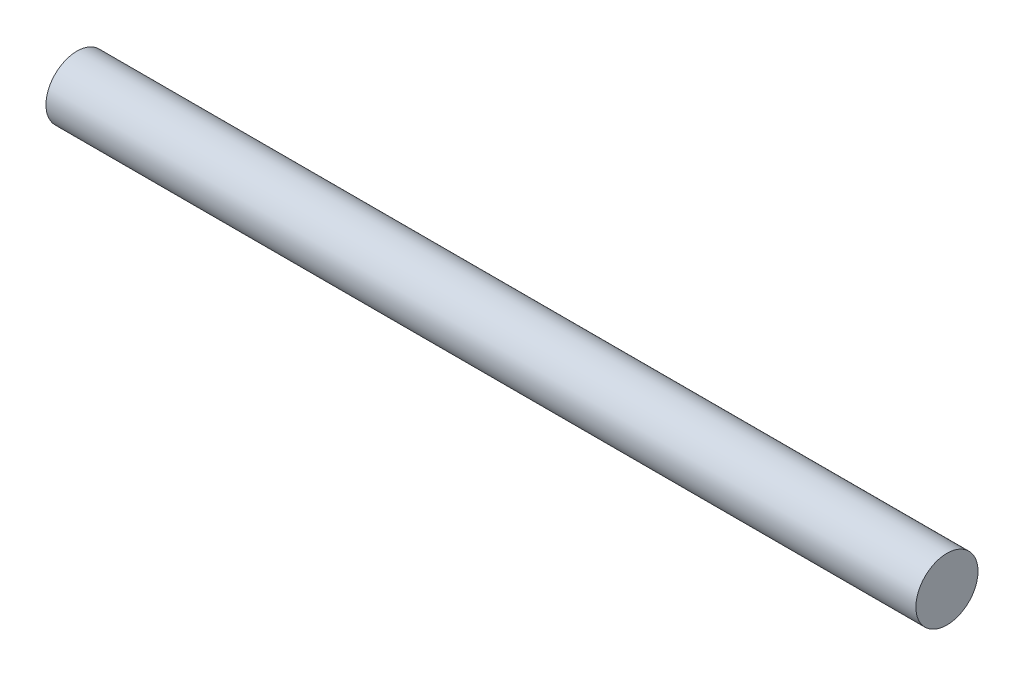
ISO-10303-21;
HEADER;
FILE_DESCRIPTION(('STEP AP214'),'2;1');
FILE_NAME('part.step','',(''),(''),'','','');
FILE_SCHEMA(('AUTOMOTIVE_DESIGN { 1 0 10303 214 1 1 1 1 }'));
ENDSEC;
DATA;
#1=APPLICATION_CONTEXT('core data for automotive mechanical design processes');
#2=APPLICATION_PROTOCOL_DEFINITION('international standard','automotive_design',2000,#1);
#3=PRODUCT_CONTEXT('',#1,'mechanical');
#4=PRODUCT('Part','Part','',(#3));
#5=PRODUCT_RELATED_PRODUCT_CATEGORY('part','',(#4));
#6=PRODUCT_DEFINITION_FORMATION('','',#4);
#7=PRODUCT_DEFINITION_CONTEXT('part definition',#1,'design');
#8=PRODUCT_DEFINITION('design','',#6,#7);
#9=PRODUCT_DEFINITION_SHAPE('','',#8);
#10=(LENGTH_UNIT() NAMED_UNIT(*) SI_UNIT(.MILLI.,.METRE.));
#11=(NAMED_UNIT(*) PLANE_ANGLE_UNIT() SI_UNIT($,.RADIAN.));
#12=(NAMED_UNIT(*) SI_UNIT($,.STERADIAN.) SOLID_ANGLE_UNIT());
#13=UNCERTAINTY_MEASURE_WITH_UNIT(LENGTH_MEASURE(1.E-05),#10,'distance_accuracy_value','');
#14=(GEOMETRIC_REPRESENTATION_CONTEXT(3) GLOBAL_UNCERTAINTY_ASSIGNED_CONTEXT((#13)) GLOBAL_UNIT_ASSIGNED_CONTEXT((#10,
#11,#12)) REPRESENTATION_CONTEXT('',''));
#15=CARTESIAN_POINT('',(0.,0.,0.));
#16=DIRECTION('',(0.,0.,1.));
#17=DIRECTION('',(1.,0.,0.));
#18=AXIS2_PLACEMENT_3D('',#15,#16,#17);
#19=CARTESIAN_POINT('',(14.,0.,0.));
#20=DIRECTION('',(-1.,0.,0.));
#21=DIRECTION('',(0.,0.,1.));
#22=AXIS2_PLACEMENT_3D('',#19,#20,#21);
#23=CYLINDRICAL_SURFACE('',#22,0.5);
#24=CARTESIAN_POINT('',(14.,0.,0.));
#25=DIRECTION('',(1.,0.,0.));
#26=DIRECTION('',(0.,0.,-1.));
#27=AXIS2_PLACEMENT_3D('',#24,#25,#26);
#28=CIRCLE('',#27,0.5);
#29=CARTESIAN_POINT('',(14.,0.,-0.5));
#30=VERTEX_POINT('',#29);
#31=EDGE_CURVE('E10',#30,#30,#28,.T.);
#32=ORIENTED_EDGE('',*,*,#31,.F.);
#33=EDGE_LOOP('',(#32));
#34=FACE_BOUND('',#33,.T.);
#35=CARTESIAN_POINT('',(0.,0.,0.));
#36=DIRECTION('',(1.,0.,0.));
#37=DIRECTION('',(0.,0.,-1.));
#38=AXIS2_PLACEMENT_3D('',#35,#36,#37);
#39=CIRCLE('',#38,0.5);
#40=CARTESIAN_POINT('',(0.,0.,-0.5));
#41=VERTEX_POINT('',#40);
#42=EDGE_CURVE('E34',#41,#41,#39,.T.);
#43=ORIENTED_EDGE('',*,*,#42,.T.);
#44=EDGE_LOOP('',(#43));
#45=FACE_BOUND('',#44,.T.);
#46=ADVANCED_FACE('F31',(#34,#45),#23,.T.);
#47=CARTESIAN_POINT('',(14.,0.,0.));
#48=DIRECTION('',(1.,0.,0.));
#49=DIRECTION('',(0.,0.,-1.));
#50=AXIS2_PLACEMENT_3D('',#47,#48,#49);
#51=PLANE('',#50);
#52=ORIENTED_EDGE('',*,*,#31,.T.);
#53=EDGE_LOOP('',(#52));
#54=FACE_BOUND('',#53,.T.);
#55=ADVANCED_FACE('F46',(#54),#51,.T.);
#56=CARTESIAN_POINT('',(0.,0.,0.));
#57=DIRECTION('',(1.,0.,0.));
#58=DIRECTION('',(0.,0.,-1.));
#59=AXIS2_PLACEMENT_3D('',#56,#57,#58);
#60=PLANE('',#59);
#61=ORIENTED_EDGE('',*,*,#42,.F.);
#62=EDGE_LOOP('',(#61));
#63=FACE_BOUND('',#62,.T.);
#64=ADVANCED_FACE('F44',(#63),#60,.F.);
#65=CLOSED_SHELL('',(#46,#55,#64));
#66=MANIFOLD_SOLID_BREP('B2',#65);
#67=ADVANCED_BREP_SHAPE_REPRESENTATION('',(#18,#66),#14);
#68=SHAPE_DEFINITION_REPRESENTATION(#9,#67);
ENDSEC;
END-ISO-10303-21;
